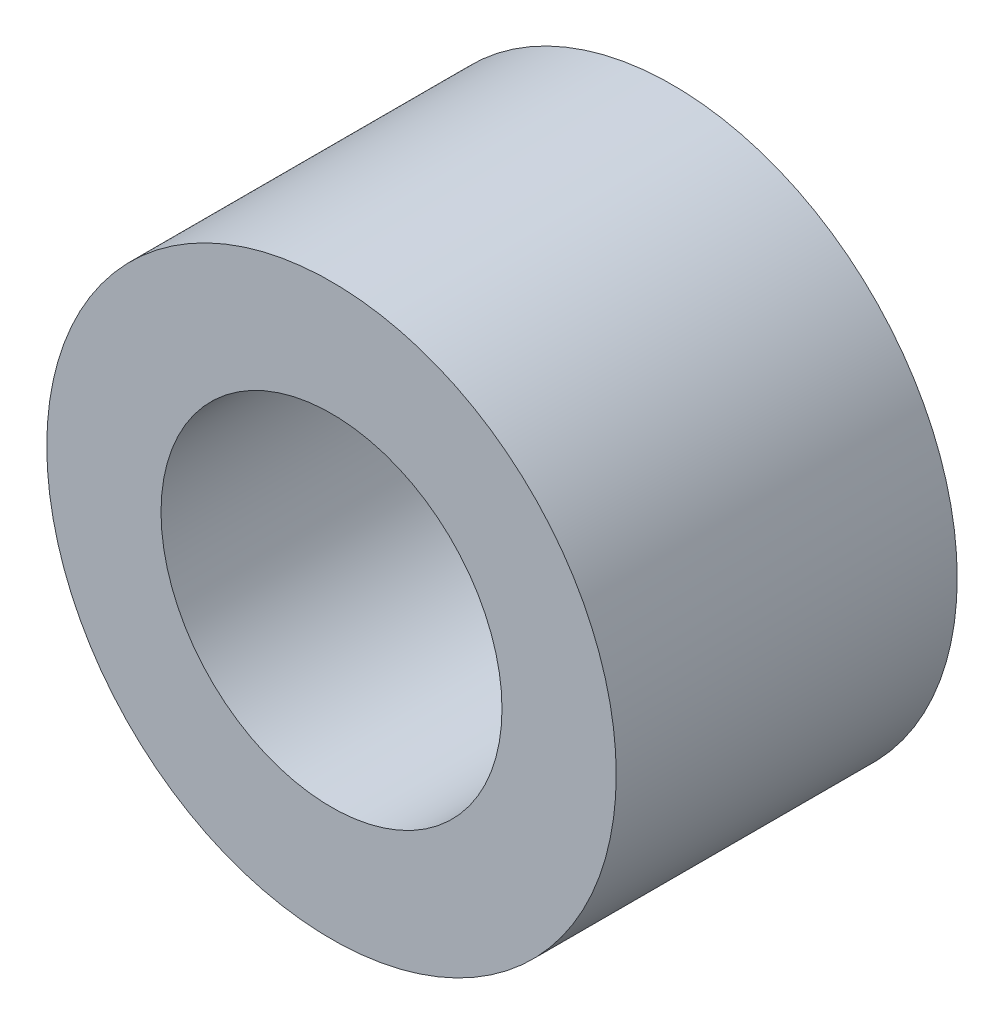
ISO-10303-21;
HEADER;
FILE_DESCRIPTION(('STEP AP214'),'2;1');
FILE_NAME('part.step','',(''),(''),'','','');
FILE_SCHEMA(('AUTOMOTIVE_DESIGN { 1 0 10303 214 1 1 1 1 }'));
ENDSEC;
DATA;
#1=APPLICATION_CONTEXT('core data for automotive mechanical design processes');
#2=APPLICATION_PROTOCOL_DEFINITION('international standard','automotive_design',2000,#1);
#3=PRODUCT_CONTEXT('',#1,'mechanical');
#4=PRODUCT('Part','Part','',(#3));
#5=PRODUCT_RELATED_PRODUCT_CATEGORY('part','',(#4));
#6=PRODUCT_DEFINITION_FORMATION('','',#4);
#7=PRODUCT_DEFINITION_CONTEXT('part definition',#1,'design');
#8=PRODUCT_DEFINITION('design','',#6,#7);
#9=PRODUCT_DEFINITION_SHAPE('','',#8);
#10=(LENGTH_UNIT() NAMED_UNIT(*) SI_UNIT(.MILLI.,.METRE.));
#11=(NAMED_UNIT(*) PLANE_ANGLE_UNIT() SI_UNIT($,.RADIAN.));
#12=(NAMED_UNIT(*) SI_UNIT($,.STERADIAN.) SOLID_ANGLE_UNIT());
#13=UNCERTAINTY_MEASURE_WITH_UNIT(LENGTH_MEASURE(1.E-05),#10,'distance_accuracy_value','');
#14=(GEOMETRIC_REPRESENTATION_CONTEXT(3) GLOBAL_UNCERTAINTY_ASSIGNED_CONTEXT((#13)) GLOBAL_UNIT_ASSIGNED_CONTEXT((#10,
#11,#12)) REPRESENTATION_CONTEXT('',''));
#15=CARTESIAN_POINT('',(0.,0.,0.));
#16=DIRECTION('',(0.,0.,1.));
#17=DIRECTION('',(1.,0.,0.));
#18=AXIS2_PLACEMENT_3D('',#15,#16,#17);
#19=CARTESIAN_POINT('',(0.,0.,3.));
#20=DIRECTION('',(0.,0.,1.));
#21=DIRECTION('',(1.,0.,0.));
#22=AXIS2_PLACEMENT_3D('',#19,#20,#21);
#23=PLANE('',#22);
#24=CARTESIAN_POINT('',(0.,0.,3.));
#25=DIRECTION('',(0.,0.,1.));
#26=DIRECTION('',(1.,0.,0.));
#27=AXIS2_PLACEMENT_3D('',#24,#25,#26);
#28=CIRCLE('',#27,5.01);
#29=CARTESIAN_POINT('',(5.01,0.,3.));
#30=VERTEX_POINT('',#29);
#31=EDGE_CURVE('E10',#30,#30,#28,.T.);
#32=ORIENTED_EDGE('',*,*,#31,.T.);
#33=EDGE_LOOP('',(#32));
#34=FACE_BOUND('',#33,.T.);
#35=CARTESIAN_POINT('',(0.,0.,3.));
#36=DIRECTION('',(0.,0.,1.));
#37=DIRECTION('',(1.,0.,0.));
#38=AXIS2_PLACEMENT_3D('',#35,#36,#37);
#39=CIRCLE('',#38,3.);
#40=CARTESIAN_POINT('',(3.,0.,3.));
#41=VERTEX_POINT('',#40);
#42=EDGE_CURVE('E42',#41,#41,#39,.T.);
#43=ORIENTED_EDGE('',*,*,#42,.F.);
#44=EDGE_LOOP('',(#43));
#45=FACE_BOUND('',#44,.T.);
#46=ADVANCED_FACE('F31',(#34,#45),#23,.T.);
#47=CARTESIAN_POINT('',(0.,0.,-3.));
#48=DIRECTION('',(0.,0.,1.));
#49=DIRECTION('',(1.,0.,0.));
#50=AXIS2_PLACEMENT_3D('',#47,#48,#49);
#51=PLANE('',#50);
#52=CARTESIAN_POINT('',(0.,0.,-3.));
#53=DIRECTION('',(0.,0.,1.));
#54=DIRECTION('',(1.,0.,0.));
#55=AXIS2_PLACEMENT_3D('',#52,#53,#54);
#56=CIRCLE('',#55,5.01);
#57=CARTESIAN_POINT('',(5.01,0.,-3.));
#58=VERTEX_POINT('',#57);
#59=EDGE_CURVE('E35',#58,#58,#56,.T.);
#60=ORIENTED_EDGE('',*,*,#59,.F.);
#61=EDGE_LOOP('',(#60));
#62=FACE_BOUND('',#61,.T.);
#63=CARTESIAN_POINT('',(0.,0.,-3.));
#64=DIRECTION('',(0.,0.,1.));
#65=DIRECTION('',(1.,0.,0.));
#66=AXIS2_PLACEMENT_3D('',#63,#64,#65);
#67=CIRCLE('',#66,3.);
#68=CARTESIAN_POINT('',(3.,0.,-3.));
#69=VERTEX_POINT('',#68);
#70=EDGE_CURVE('E44',#69,#69,#67,.T.);
#71=ORIENTED_EDGE('',*,*,#70,.T.);
#72=EDGE_LOOP('',(#71));
#73=FACE_BOUND('',#72,.T.);
#74=ADVANCED_FACE('F54',(#62,#73),#51,.F.);
#75=CARTESIAN_POINT('',(0.,0.,3.));
#76=DIRECTION('',(0.,0.,-1.));
#77=DIRECTION('',(-1.,0.,0.));
#78=AXIS2_PLACEMENT_3D('',#75,#76,#77);
#79=CYLINDRICAL_SURFACE('',#78,5.01);
#80=ORIENTED_EDGE('',*,*,#31,.F.);
#81=EDGE_LOOP('',(#80));
#82=FACE_BOUND('',#81,.T.);
#83=ORIENTED_EDGE('',*,*,#59,.T.);
#84=EDGE_LOOP('',(#83));
#85=FACE_BOUND('',#84,.T.);
#86=ADVANCED_FACE('F33',(#82,#85),#79,.T.);
#87=CARTESIAN_POINT('',(0.,0.,3.));
#88=DIRECTION('',(0.,0.,-1.));
#89=DIRECTION('',(-1.,0.,0.));
#90=AXIS2_PLACEMENT_3D('',#87,#88,#89);
#91=CYLINDRICAL_SURFACE('',#90,3.);
#92=ORIENTED_EDGE('',*,*,#42,.T.);
#93=EDGE_LOOP('',(#92));
#94=FACE_BOUND('',#93,.T.);
#95=ORIENTED_EDGE('',*,*,#70,.F.);
#96=EDGE_LOOP('',(#95));
#97=FACE_BOUND('',#96,.T.);
#98=ADVANCED_FACE('F50',(#94,#97),#91,.F.);
#99=CLOSED_SHELL('',(#46,#74,#86,#98));
#100=MANIFOLD_SOLID_BREP('B2',#99);
#101=ADVANCED_BREP_SHAPE_REPRESENTATION('',(#18,#100),#14);
#102=SHAPE_DEFINITION_REPRESENTATION(#9,#101);
ENDSEC;
END-ISO-10303-21;
